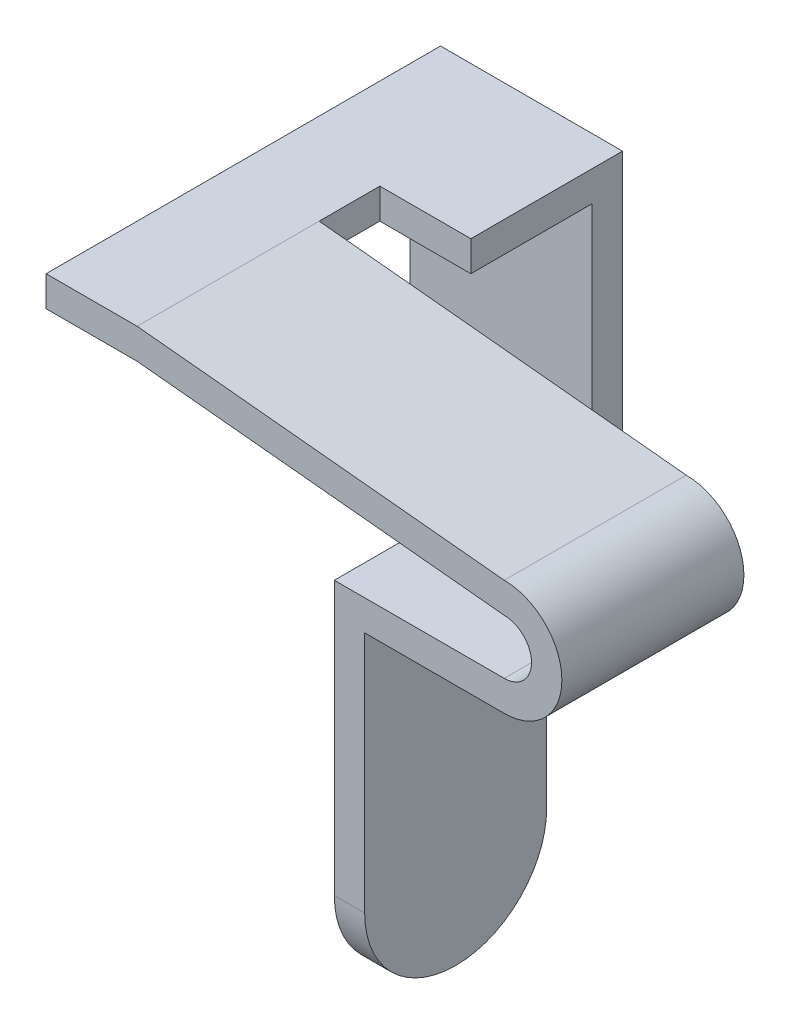
ISO-10303-21;
HEADER;
FILE_DESCRIPTION(('STEP AP214'),'2;1');
FILE_NAME('part.step','',(''),(''),'','','');
FILE_SCHEMA(('AUTOMOTIVE_DESIGN { 1 0 10303 214 1 1 1 1 }'));
ENDSEC;
DATA;
#1=APPLICATION_CONTEXT('core data for automotive mechanical design processes');
#2=APPLICATION_PROTOCOL_DEFINITION('international standard','automotive_design',2000,#1);
#3=PRODUCT_CONTEXT('',#1,'mechanical');
#4=PRODUCT('Part','Part','',(#3));
#5=PRODUCT_RELATED_PRODUCT_CATEGORY('part','',(#4));
#6=PRODUCT_DEFINITION_FORMATION('','',#4);
#7=PRODUCT_DEFINITION_CONTEXT('part definition',#1,'design');
#8=PRODUCT_DEFINITION('design','',#6,#7);
#9=PRODUCT_DEFINITION_SHAPE('','',#8);
#10=(LENGTH_UNIT() NAMED_UNIT(*) SI_UNIT(.MILLI.,.METRE.));
#11=(NAMED_UNIT(*) PLANE_ANGLE_UNIT() SI_UNIT($,.RADIAN.));
#12=(NAMED_UNIT(*) SI_UNIT($,.STERADIAN.) SOLID_ANGLE_UNIT());
#13=UNCERTAINTY_MEASURE_WITH_UNIT(LENGTH_MEASURE(1.E-05),#10,'distance_accuracy_value','');
#14=(GEOMETRIC_REPRESENTATION_CONTEXT(3) GLOBAL_UNCERTAINTY_ASSIGNED_CONTEXT((#13)) GLOBAL_UNIT_ASSIGNED_CONTEXT((#10,
#11,#12)) REPRESENTATION_CONTEXT('',''));
#15=CARTESIAN_POINT('',(0.,0.,0.));
#16=DIRECTION('',(0.,0.,1.));
#17=DIRECTION('',(1.,0.,0.));
#18=AXIS2_PLACEMENT_3D('',#15,#16,#17);
#19=CARTESIAN_POINT('',(0.,0.,3.));
#20=DIRECTION('',(0.,1.,0.));
#21=DIRECTION('',(0.,0.,1.));
#22=AXIS2_PLACEMENT_3D('',#19,#20,#21);
#23=PLANE('',#22);
#24=DIRECTION('',(-1.,0.,0.));
#25=VECTOR('',#24,1.);
#26=CARTESIAN_POINT('',(0.,0.,-3.));
#27=LINE('',#26,#25);
#28=CARTESIAN_POINT('',(3.,0.,-3.));
#29=VERTEX_POINT('',#28);
#30=CARTESIAN_POINT('',(0.,0.,-3.));
#31=VERTEX_POINT('',#30);
#32=EDGE_CURVE('E310',#29,#31,#27,.T.);
#33=ORIENTED_EDGE('',*,*,#32,.F.);
#34=DIRECTION('',(0.,0.,1.));
#35=VECTOR('',#34,1.);
#36=CARTESIAN_POINT('',(3.,0.,-3.5));
#37=LINE('',#36,#35);
#38=CARTESIAN_POINT('',(3.,0.,-1.));
#39=VERTEX_POINT('',#38);
#40=EDGE_CURVE('E213',#29,#39,#37,.T.);
#41=ORIENTED_EDGE('',*,*,#40,.T.);
#42=DIRECTION('',(-1.,0.,0.));
#43=VECTOR('',#42,1.);
#44=CARTESIAN_POINT('',(3.,0.,-1.));
#45=LINE('',#44,#43);
#46=CARTESIAN_POINT('',(1.5,0.,-1.));
#47=VERTEX_POINT('',#46);
#48=EDGE_CURVE('E203',#39,#47,#45,.T.);
#49=ORIENTED_EDGE('',*,*,#48,.T.);
#50=DIRECTION('',(0.,0.,1.));
#51=VECTOR('',#50,1.);
#52=CARTESIAN_POINT('',(1.5,0.,-1.));
#53=LINE('',#52,#51);
#54=CARTESIAN_POINT('',(1.5,0.,0.));
#55=VERTEX_POINT('',#54);
#56=EDGE_CURVE('E198',#47,#55,#53,.T.);
#57=ORIENTED_EDGE('',*,*,#56,.T.);
#58=DIRECTION('',(0.,0.,-1.));
#59=VECTOR('',#58,1.);
#60=CARTESIAN_POINT('',(1.5,0.,3.));
#61=LINE('',#60,#59);
#62=CARTESIAN_POINT('',(1.5,0.,3.));
#63=VERTEX_POINT('',#62);
#64=EDGE_CURVE('E283',#63,#55,#61,.T.);
#65=ORIENTED_EDGE('',*,*,#64,.F.);
#66=DIRECTION('',(1.,0.,0.));
#67=VECTOR('',#66,1.);
#68=CARTESIAN_POINT('',(0.,0.,3.));
#69=LINE('',#68,#67);
#70=CARTESIAN_POINT('',(0.,0.,3.));
#71=VERTEX_POINT('',#70);
#72=EDGE_CURVE('E228',#71,#63,#69,.T.);
#73=ORIENTED_EDGE('',*,*,#72,.F.);
#74=DIRECTION('',(0.,0.,-1.));
#75=VECTOR('',#74,1.);
#76=CARTESIAN_POINT('',(0.,0.,3.));
#77=LINE('',#76,#75);
#78=EDGE_CURVE('E286',#71,#31,#77,.T.);
#79=ORIENTED_EDGE('',*,*,#78,.T.);
#80=EDGE_LOOP('',(#33,#41,#49,#57,#65,#73,#79));
#81=FACE_BOUND('',#80,.T.);
#82=ADVANCED_FACE('F33',(#81),#23,.F.);
#83=CARTESIAN_POINT('',(0.,0.,3.));
#84=DIRECTION('',(1.,0.,0.));
#85=DIRECTION('',(0.,0.,-1.));
#86=AXIS2_PLACEMENT_3D('',#83,#84,#85);
#87=PLANE('',#86);
#88=DIRECTION('',(0.,-1.,0.));
#89=VECTOR('',#88,1.);
#90=CARTESIAN_POINT('',(0.,0.5,-3.5));
#91=LINE('',#90,#89);
#92=CARTESIAN_POINT('',(0.,0.5,-3.5));
#93=VERTEX_POINT('',#92);
#94=CARTESIAN_POINT('',(0.,-6.,-3.5));
#95=VERTEX_POINT('',#94);
#96=EDGE_CURVE('E171',#93,#95,#91,.T.);
#97=ORIENTED_EDGE('',*,*,#96,.T.);
#98=DIRECTION('',(0.,0.,1.));
#99=VECTOR('',#98,1.);
#100=CARTESIAN_POINT('',(0.,-6.,3.));
#101=LINE('',#100,#99);
#102=CARTESIAN_POINT('',(0.,-6.,-3.));
#103=VERTEX_POINT('',#102);
#104=EDGE_CURVE('E289',#95,#103,#101,.T.);
#105=ORIENTED_EDGE('',*,*,#104,.T.);
#106=DIRECTION('',(0.,1.,0.));
#107=VECTOR('',#106,1.);
#108=CARTESIAN_POINT('',(0.,-10.5413812651491,-3.));
#109=LINE('',#108,#107);
#110=EDGE_CURVE('E314',#103,#31,#109,.T.);
#111=ORIENTED_EDGE('',*,*,#110,.T.);
#112=ORIENTED_EDGE('',*,*,#78,.F.);
#113=DIRECTION('',(0.,-1.,0.));
#114=VECTOR('',#113,1.);
#115=CARTESIAN_POINT('',(0.,0.,3.));
#116=LINE('',#115,#114);
#117=CARTESIAN_POINT('',(0.,0.5,3.));
#118=VERTEX_POINT('',#117);
#119=EDGE_CURVE('E175',#118,#71,#116,.T.);
#120=ORIENTED_EDGE('',*,*,#119,.F.);
#121=DIRECTION('',(0.,0.,-1.));
#122=VECTOR('',#121,1.);
#123=CARTESIAN_POINT('',(0.,0.5,3.));
#124=LINE('',#123,#122);
#125=EDGE_CURVE('E167',#118,#93,#124,.T.);
#126=ORIENTED_EDGE('',*,*,#125,.T.);
#127=EDGE_LOOP('',(#97,#105,#111,#112,#120,#126));
#128=FACE_BOUND('',#127,.T.);
#129=ADVANCED_FACE('F169',(#128),#87,.F.);
#130=CARTESIAN_POINT('',(1.5,0.,3.));
#131=DIRECTION('',(0.0986894165901574,0.995118283950754,0.));
#132=DIRECTION('',(-0.995118283950755,0.0986894165901574,0.));
#133=AXIS2_PLACEMENT_3D('',#130,#131,#132);
#134=PLANE('',#133);
#135=DIRECTION('',(0.995118283950755,-0.0986894165901574,0.));
#136=VECTOR('',#135,1.);
#137=CARTESIAN_POINT('',(1.5,0.,0.));
#138=LINE('',#137,#136);
#139=CARTESIAN_POINT('',(7.55,-0.6,0.));
#140=VERTEX_POINT('',#139);
#141=EDGE_CURVE('E220',#55,#140,#138,.T.);
#142=ORIENTED_EDGE('',*,*,#141,.T.);
#143=DIRECTION('',(0.,0.,-1.));
#144=VECTOR('',#143,1.);
#145=CARTESIAN_POINT('',(7.55,-0.6,3.));
#146=LINE('',#145,#144);
#147=CARTESIAN_POINT('',(7.55,-0.6,3.));
#148=VERTEX_POINT('',#147);
#149=EDGE_CURVE('E280',#148,#140,#146,.T.);
#150=ORIENTED_EDGE('',*,*,#149,.F.);
#151=DIRECTION('',(0.995118283950755,-0.0986894165901574,0.));
#152=VECTOR('',#151,1.);
#153=CARTESIAN_POINT('',(1.5,0.,3.));
#154=LINE('',#153,#152);
#155=EDGE_CURVE('E231',#63,#148,#154,.T.);
#156=ORIENTED_EDGE('',*,*,#155,.F.);
#157=ORIENTED_EDGE('',*,*,#64,.T.);
#158=EDGE_LOOP('',(#142,#150,#156,#157));
#159=FACE_BOUND('',#158,.T.);
#160=ADVANCED_FACE('F358',(#159),#134,.F.);
#161=CARTESIAN_POINT('',(7.55,-1.05,3.));
#162=DIRECTION('',(0.,0.,-1.));
#163=DIRECTION('',(-1.,0.,0.));
#164=AXIS2_PLACEMENT_3D('',#161,#162,#163);
#165=CYLINDRICAL_SURFACE('',#164,0.45);
#166=CARTESIAN_POINT('',(7.55,-1.05,0.));
#167=DIRECTION('',(0.,0.,-1.));
#168=DIRECTION('',(-1.,0.,0.));
#169=AXIS2_PLACEMENT_3D('',#166,#167,#168);
#170=CIRCLE('',#169,0.45);
#171=CARTESIAN_POINT('',(7.55,-1.5,0.));
#172=VERTEX_POINT('',#171);
#173=EDGE_CURVE('E250',#140,#172,#170,.T.);
#174=ORIENTED_EDGE('',*,*,#173,.T.);
#175=DIRECTION('',(0.,0.,-1.));
#176=VECTOR('',#175,1.);
#177=CARTESIAN_POINT('',(7.55,-1.5,3.));
#178=LINE('',#177,#176);
#179=CARTESIAN_POINT('',(7.55,-1.5,3.));
#180=VERTEX_POINT('',#179);
#181=EDGE_CURVE('E277',#180,#172,#178,.T.);
#182=ORIENTED_EDGE('',*,*,#181,.F.);
#183=CARTESIAN_POINT('',(7.55,-1.05,3.));
#184=DIRECTION('',(0.,0.,-1.));
#185=DIRECTION('',(-1.,0.,0.));
#186=AXIS2_PLACEMENT_3D('',#183,#184,#185);
#187=CIRCLE('',#186,0.45);
#188=EDGE_CURVE('E233',#148,#180,#187,.T.);
#189=ORIENTED_EDGE('',*,*,#188,.F.);
#190=ORIENTED_EDGE('',*,*,#149,.T.);
#191=EDGE_LOOP('',(#174,#182,#189,#190));
#192=FACE_BOUND('',#191,.T.);
#193=ADVANCED_FACE('F354',(#192),#165,.F.);
#194=CARTESIAN_POINT('',(7.55,-1.5,3.));
#195=DIRECTION('',(0.,-1.,0.));
#196=DIRECTION('',(1.,0.,0.));
#197=AXIS2_PLACEMENT_3D('',#194,#195,#196);
#198=PLANE('',#197);
#199=DIRECTION('',(-1.,0.,0.));
#200=VECTOR('',#199,1.);
#201=CARTESIAN_POINT('',(7.55,-1.5,0.));
#202=LINE('',#201,#200);
#203=CARTESIAN_POINT('',(4.75,-1.5,0.));
#204=VERTEX_POINT('',#203);
#205=EDGE_CURVE('E252',#172,#204,#202,.T.);
#206=ORIENTED_EDGE('',*,*,#205,.T.);
#207=DIRECTION('',(0.,0.,-1.));
#208=VECTOR('',#207,1.);
#209=CARTESIAN_POINT('',(4.75,-1.5,3.));
#210=LINE('',#209,#208);
#211=CARTESIAN_POINT('',(4.75,-1.5,3.));
#212=VERTEX_POINT('',#211);
#213=EDGE_CURVE('E274',#212,#204,#210,.T.);
#214=ORIENTED_EDGE('',*,*,#213,.F.);
#215=DIRECTION('',(-1.,0.,0.));
#216=VECTOR('',#215,1.);
#217=CARTESIAN_POINT('',(7.55,-1.5,3.));
#218=LINE('',#217,#216);
#219=EDGE_CURVE('E235',#180,#212,#218,.T.);
#220=ORIENTED_EDGE('',*,*,#219,.F.);
#221=ORIENTED_EDGE('',*,*,#181,.T.);
#222=EDGE_LOOP('',(#206,#214,#220,#221));
#223=FACE_BOUND('',#222,.T.);
#224=ADVANCED_FACE('F350',(#223),#198,.F.);
#225=CARTESIAN_POINT('',(4.75,-1.5,3.));
#226=DIRECTION('',(1.,0.,0.));
#227=DIRECTION('',(0.,1.,0.));
#228=AXIS2_PLACEMENT_3D('',#225,#226,#227);
#229=PLANE('',#228);
#230=CARTESIAN_POINT('',(4.75,-6.,1.5));
#231=DIRECTION('',(1.,0.,0.));
#232=DIRECTION('',(0.,1.,0.));
#233=AXIS2_PLACEMENT_3D('',#230,#231,#232);
#234=CIRCLE('',#233,1.5);
#235=CARTESIAN_POINT('',(4.75,-6.,0.));
#236=VERTEX_POINT('',#235);
#237=CARTESIAN_POINT('',(4.75,-7.5,1.5));
#238=VERTEX_POINT('',#237);
#239=EDGE_CURVE('E50',#236,#238,#234,.F.);
#240=ORIENTED_EDGE('',*,*,#239,.T.);
#241=CARTESIAN_POINT('',(4.75,-6.,1.5));
#242=DIRECTION('',(1.,0.,0.));
#243=DIRECTION('',(0.,1.,0.));
#244=AXIS2_PLACEMENT_3D('',#241,#242,#243);
#245=CIRCLE('',#244,1.5);
#246=CARTESIAN_POINT('',(4.75,-6.,3.));
#247=VERTEX_POINT('',#246);
#248=EDGE_CURVE('E42',#238,#247,#245,.F.);
#249=ORIENTED_EDGE('',*,*,#248,.T.);
#250=DIRECTION('',(0.,-1.,0.));
#251=VECTOR('',#250,1.);
#252=CARTESIAN_POINT('',(4.75,-1.5,3.));
#253=LINE('',#252,#251);
#254=EDGE_CURVE('E237',#212,#247,#253,.T.);
#255=ORIENTED_EDGE('',*,*,#254,.F.);
#256=ORIENTED_EDGE('',*,*,#213,.T.);
#257=DIRECTION('',(0.,-1.,0.));
#258=VECTOR('',#257,1.);
#259=CARTESIAN_POINT('',(4.75,-1.5,0.));
#260=LINE('',#259,#258);
#261=EDGE_CURVE('E254',#204,#236,#260,.T.);
#262=ORIENTED_EDGE('',*,*,#261,.T.);
#263=EDGE_LOOP('',(#240,#249,#255,#256,#262));
#264=FACE_BOUND('',#263,.T.);
#265=ADVANCED_FACE('F346',(#264),#229,.F.);
#266=CARTESIAN_POINT('',(5.25,-7.5,3.));
#267=DIRECTION('',(-1.,0.,0.));
#268=DIRECTION('',(0.,0.,1.));
#269=AXIS2_PLACEMENT_3D('',#266,#267,#268);
#270=PLANE('',#269);
#271=DIRECTION('',(0.,1.,0.));
#272=VECTOR('',#271,1.);
#273=CARTESIAN_POINT('',(5.25,-7.5,3.));
#274=LINE('',#273,#272);
#275=CARTESIAN_POINT('',(5.25,-6.,3.));
#276=VERTEX_POINT('',#275);
#277=CARTESIAN_POINT('',(5.25,-2.,3.));
#278=VERTEX_POINT('',#277);
#279=EDGE_CURVE('E240',#276,#278,#274,.T.);
#280=ORIENTED_EDGE('',*,*,#279,.F.);
#281=CARTESIAN_POINT('',(5.25,-6.,1.5));
#282=DIRECTION('',(-1.,0.,0.));
#283=DIRECTION('',(0.,0.,1.));
#284=AXIS2_PLACEMENT_3D('',#281,#282,#283);
#285=CIRCLE('',#284,1.5);
#286=CARTESIAN_POINT('',(5.25,-7.5,1.5));
#287=VERTEX_POINT('',#286);
#288=EDGE_CURVE('E305',#276,#287,#285,.F.);
#289=ORIENTED_EDGE('',*,*,#288,.T.);
#290=CARTESIAN_POINT('',(5.25,-6.,1.5));
#291=DIRECTION('',(-1.,0.,0.));
#292=DIRECTION('',(0.,0.,1.));
#293=AXIS2_PLACEMENT_3D('',#290,#291,#292);
#294=CIRCLE('',#293,1.5);
#295=CARTESIAN_POINT('',(5.25,-6.,0.));
#296=VERTEX_POINT('',#295);
#297=EDGE_CURVE('E303',#287,#296,#294,.F.);
#298=ORIENTED_EDGE('',*,*,#297,.T.);
#299=DIRECTION('',(0.,1.,0.));
#300=VECTOR('',#299,1.);
#301=CARTESIAN_POINT('',(5.25,-7.5,0.));
#302=LINE('',#301,#300);
#303=CARTESIAN_POINT('',(5.25,-2.,0.));
#304=VERTEX_POINT('',#303);
#305=EDGE_CURVE('E256',#296,#304,#302,.T.);
#306=ORIENTED_EDGE('',*,*,#305,.T.);
#307=DIRECTION('',(0.,0.,-1.));
#308=VECTOR('',#307,1.);
#309=CARTESIAN_POINT('',(5.25,-2.,3.));
#310=LINE('',#309,#308);
#311=EDGE_CURVE('E271',#278,#304,#310,.T.);
#312=ORIENTED_EDGE('',*,*,#311,.F.);
#313=EDGE_LOOP('',(#280,#289,#298,#306,#312));
#314=FACE_BOUND('',#313,.T.);
#315=ADVANCED_FACE('F325',(#314),#270,.F.);
#316=CARTESIAN_POINT('',(5.25,-2.,3.));
#317=DIRECTION('',(0.,1.,0.));
#318=DIRECTION('',(0.,0.,1.));
#319=AXIS2_PLACEMENT_3D('',#316,#317,#318);
#320=PLANE('',#319);
#321=DIRECTION('',(1.,0.,0.));
#322=VECTOR('',#321,1.);
#323=CARTESIAN_POINT('',(5.25,-2.,0.));
#324=LINE('',#323,#322);
#325=CARTESIAN_POINT('',(7.55,-2.,0.));
#326=VERTEX_POINT('',#325);
#327=EDGE_CURVE('E258',#304,#326,#324,.T.);
#328=ORIENTED_EDGE('',*,*,#327,.T.);
#329=DIRECTION('',(0.,0.,-1.));
#330=VECTOR('',#329,1.);
#331=CARTESIAN_POINT('',(7.55,-2.,3.));
#332=LINE('',#331,#330);
#333=CARTESIAN_POINT('',(7.55,-2.,3.));
#334=VERTEX_POINT('',#333);
#335=EDGE_CURVE('E268',#334,#326,#332,.T.);
#336=ORIENTED_EDGE('',*,*,#335,.F.);
#337=DIRECTION('',(1.,0.,0.));
#338=VECTOR('',#337,1.);
#339=CARTESIAN_POINT('',(5.25,-2.,3.));
#340=LINE('',#339,#338);
#341=EDGE_CURVE('E242',#278,#334,#340,.T.);
#342=ORIENTED_EDGE('',*,*,#341,.F.);
#343=ORIENTED_EDGE('',*,*,#311,.T.);
#344=EDGE_LOOP('',(#328,#336,#342,#343));
#345=FACE_BOUND('',#344,.T.);
#346=ADVANCED_FACE('F333',(#345),#320,.F.);
#347=CARTESIAN_POINT('',(7.55,-1.05,3.));
#348=DIRECTION('',(0.,0.,-1.));
#349=DIRECTION('',(-1.,0.,0.));
#350=AXIS2_PLACEMENT_3D('',#347,#348,#349);
#351=CYLINDRICAL_SURFACE('',#350,0.95);
#352=CARTESIAN_POINT('',(7.55,-1.05,0.));
#353=DIRECTION('',(0.,0.,1.));
#354=DIRECTION('',(-1.,0.,0.));
#355=AXIS2_PLACEMENT_3D('',#352,#353,#354);
#356=CIRCLE('',#355,0.95);
#357=CARTESIAN_POINT('',(7.55,-0.0999999999999998,0.));
#358=VERTEX_POINT('',#357);
#359=EDGE_CURVE('E260',#326,#358,#356,.T.);
#360=ORIENTED_EDGE('',*,*,#359,.T.);
#361=DIRECTION('',(0.,0.,-1.));
#362=VECTOR('',#361,1.);
#363=CARTESIAN_POINT('',(7.55,-0.0999999999999998,3.));
#364=LINE('',#363,#362);
#365=CARTESIAN_POINT('',(7.55,-0.0999999999999998,3.));
#366=VERTEX_POINT('',#365);
#367=EDGE_CURVE('E265',#366,#358,#364,.T.);
#368=ORIENTED_EDGE('',*,*,#367,.F.);
#369=CARTESIAN_POINT('',(7.55,-1.05,3.));
#370=DIRECTION('',(0.,0.,1.));
#371=DIRECTION('',(-1.,0.,0.));
#372=AXIS2_PLACEMENT_3D('',#369,#370,#371);
#373=CIRCLE('',#372,0.95);
#374=EDGE_CURVE('E244',#334,#366,#373,.T.);
#375=ORIENTED_EDGE('',*,*,#374,.F.);
#376=ORIENTED_EDGE('',*,*,#335,.T.);
#377=EDGE_LOOP('',(#360,#368,#375,#376));
#378=FACE_BOUND('',#377,.T.);
#379=ADVANCED_FACE('F337',(#378),#351,.T.);
#380=CARTESIAN_POINT('',(1.5,0.5,3.));
#381=DIRECTION('',(-0.0986894165901574,-0.995118283950755,0.));
#382=DIRECTION('',(0.995118283950755,-0.0986894165901574,0.));
#383=AXIS2_PLACEMENT_3D('',#380,#381,#382);
#384=PLANE('',#383);
#385=DIRECTION('',(-0.995118283950754,0.0986894165901574,0.));
#386=VECTOR('',#385,1.);
#387=CARTESIAN_POINT('',(1.5,0.5,0.));
#388=LINE('',#387,#386);
#389=CARTESIAN_POINT('',(1.5,0.5,0.));
#390=VERTEX_POINT('',#389);
#391=EDGE_CURVE('E229',#358,#390,#388,.T.);
#392=ORIENTED_EDGE('',*,*,#391,.T.);
#393=DIRECTION('',(0.,0.,-1.));
#394=VECTOR('',#393,1.);
#395=CARTESIAN_POINT('',(1.5,0.5,3.));
#396=LINE('',#395,#394);
#397=CARTESIAN_POINT('',(1.5,0.5,3.));
#398=VERTEX_POINT('',#397);
#399=EDGE_CURVE('E179',#398,#390,#396,.T.);
#400=ORIENTED_EDGE('',*,*,#399,.F.);
#401=DIRECTION('',(-0.995118283950754,0.0986894165901574,0.));
#402=VECTOR('',#401,1.);
#403=CARTESIAN_POINT('',(1.5,0.5,3.));
#404=LINE('',#403,#402);
#405=EDGE_CURVE('E246',#366,#398,#404,.T.);
#406=ORIENTED_EDGE('',*,*,#405,.F.);
#407=ORIENTED_EDGE('',*,*,#367,.T.);
#408=EDGE_LOOP('',(#392,#400,#406,#407));
#409=FACE_BOUND('',#408,.T.);
#410=ADVANCED_FACE('F363',(#409),#384,.F.);
#411=CARTESIAN_POINT('',(0.,0.5,3.));
#412=DIRECTION('',(0.,-1.,0.));
#413=DIRECTION('',(0.,0.,-1.));
#414=AXIS2_PLACEMENT_3D('',#411,#412,#413);
#415=PLANE('',#414);
#416=ORIENTED_EDGE('',*,*,#399,.T.);
#417=DIRECTION('',(0.,0.,1.));
#418=VECTOR('',#417,1.);
#419=CARTESIAN_POINT('',(1.5,0.5,-1.));
#420=LINE('',#419,#418);
#421=CARTESIAN_POINT('',(1.5,0.5,-1.));
#422=VERTEX_POINT('',#421);
#423=EDGE_CURVE('E190',#422,#390,#420,.T.);
#424=ORIENTED_EDGE('',*,*,#423,.F.);
#425=DIRECTION('',(-1.,0.,0.));
#426=VECTOR('',#425,1.);
#427=CARTESIAN_POINT('',(3.,0.5,-1.));
#428=LINE('',#427,#426);
#429=CARTESIAN_POINT('',(3.,0.5,-1.));
#430=VERTEX_POINT('',#429);
#431=EDGE_CURVE('E200',#430,#422,#428,.T.);
#432=ORIENTED_EDGE('',*,*,#431,.F.);
#433=DIRECTION('',(0.,0.,1.));
#434=VECTOR('',#433,1.);
#435=CARTESIAN_POINT('',(3.,0.5,-3.5));
#436=LINE('',#435,#434);
#437=CARTESIAN_POINT('',(3.,0.5,-3.5));
#438=VERTEX_POINT('',#437);
#439=EDGE_CURVE('E197',#438,#430,#436,.T.);
#440=ORIENTED_EDGE('',*,*,#439,.F.);
#441=DIRECTION('',(1.,0.,0.));
#442=VECTOR('',#441,1.);
#443=CARTESIAN_POINT('',(0.,0.5,-3.5));
#444=LINE('',#443,#442);
#445=EDGE_CURVE('E186',#93,#438,#444,.T.);
#446=ORIENTED_EDGE('',*,*,#445,.F.);
#447=ORIENTED_EDGE('',*,*,#125,.F.);
#448=DIRECTION('',(-1.,0.,0.));
#449=VECTOR('',#448,1.);
#450=CARTESIAN_POINT('',(0.,0.5,3.));
#451=LINE('',#450,#449);
#452=EDGE_CURVE('E180',#398,#118,#451,.T.);
#453=ORIENTED_EDGE('',*,*,#452,.F.);
#454=EDGE_LOOP('',(#416,#424,#432,#440,#446,#447,#453));
#455=FACE_BOUND('',#454,.T.);
#456=ADVANCED_FACE('F194',(#455),#415,.F.);
#457=CARTESIAN_POINT('',(7.55,-1.05,3.));
#458=DIRECTION('',(0.,0.,-1.));
#459=DIRECTION('',(-1.,0.,0.));
#460=AXIS2_PLACEMENT_3D('',#457,#458,#459);
#461=PLANE('',#460);
#462=ORIENTED_EDGE('',*,*,#254,.T.);
#463=DIRECTION('',(1.,0.,0.));
#464=VECTOR('',#463,1.);
#465=CARTESIAN_POINT('',(7.55,-6.,3.));
#466=LINE('',#465,#464);
#467=EDGE_CURVE('E300',#247,#276,#466,.T.);
#468=ORIENTED_EDGE('',*,*,#467,.T.);
#469=ORIENTED_EDGE('',*,*,#279,.T.);
#470=ORIENTED_EDGE('',*,*,#341,.T.);
#471=ORIENTED_EDGE('',*,*,#374,.T.);
#472=ORIENTED_EDGE('',*,*,#405,.T.);
#473=ORIENTED_EDGE('',*,*,#452,.T.);
#474=ORIENTED_EDGE('',*,*,#119,.T.);
#475=ORIENTED_EDGE('',*,*,#72,.T.);
#476=ORIENTED_EDGE('',*,*,#155,.T.);
#477=ORIENTED_EDGE('',*,*,#188,.T.);
#478=ORIENTED_EDGE('',*,*,#219,.T.);
#479=EDGE_LOOP('',(#462,#468,#469,#470,#471,#472,#473,#474,#475,#476,#477,#478));
#480=FACE_BOUND('',#479,.T.);
#481=ADVANCED_FACE('F341',(#480),#461,.F.);
#482=CARTESIAN_POINT('',(7.55,-1.05,0.));
#483=DIRECTION('',(0.,0.,-1.));
#484=DIRECTION('',(-1.,0.,0.));
#485=AXIS2_PLACEMENT_3D('',#482,#483,#484);
#486=PLANE('',#485);
#487=ORIENTED_EDGE('',*,*,#305,.F.);
#488=DIRECTION('',(1.,0.,0.));
#489=VECTOR('',#488,1.);
#490=CARTESIAN_POINT('',(4.75,-6.,0.));
#491=LINE('',#490,#489);
#492=EDGE_CURVE('E11',#296,#236,#491,.F.);
#493=ORIENTED_EDGE('',*,*,#492,.T.);
#494=ORIENTED_EDGE('',*,*,#261,.F.);
#495=ORIENTED_EDGE('',*,*,#205,.F.);
#496=ORIENTED_EDGE('',*,*,#173,.F.);
#497=ORIENTED_EDGE('',*,*,#141,.F.);
#498=DIRECTION('',(0.,-1.,0.));
#499=VECTOR('',#498,1.);
#500=CARTESIAN_POINT('',(1.5,0.5,0.));
#501=LINE('',#500,#499);
#502=EDGE_CURVE('E217',#390,#55,#501,.T.);
#503=ORIENTED_EDGE('',*,*,#502,.F.);
#504=ORIENTED_EDGE('',*,*,#391,.F.);
#505=ORIENTED_EDGE('',*,*,#359,.F.);
#506=ORIENTED_EDGE('',*,*,#327,.F.);
#507=EDGE_LOOP('',(#487,#493,#494,#495,#496,#497,#503,#504,#505,#506));
#508=FACE_BOUND('',#507,.T.);
#509=ADVANCED_FACE('F328',(#508),#486,.T.);
#510=CARTESIAN_POINT('',(1.5,0.5,-1.));
#511=DIRECTION('',(1.,0.,0.));
#512=DIRECTION('',(0.,0.,-1.));
#513=AXIS2_PLACEMENT_3D('',#510,#511,#512);
#514=PLANE('',#513);
#515=ORIENTED_EDGE('',*,*,#56,.F.);
#516=DIRECTION('',(0.,-1.,0.));
#517=VECTOR('',#516,1.);
#518=CARTESIAN_POINT('',(1.5,0.5,-1.));
#519=LINE('',#518,#517);
#520=EDGE_CURVE('E221',#422,#47,#519,.T.);
#521=ORIENTED_EDGE('',*,*,#520,.F.);
#522=ORIENTED_EDGE('',*,*,#423,.T.);
#523=ORIENTED_EDGE('',*,*,#502,.T.);
#524=EDGE_LOOP('',(#515,#521,#522,#523));
#525=FACE_BOUND('',#524,.T.);
#526=ADVANCED_FACE('F365',(#525),#514,.T.);
#527=CARTESIAN_POINT('',(3.,0.5,-1.));
#528=DIRECTION('',(0.,0.,1.));
#529=DIRECTION('',(1.,0.,0.));
#530=AXIS2_PLACEMENT_3D('',#527,#528,#529);
#531=PLANE('',#530);
#532=ORIENTED_EDGE('',*,*,#48,.F.);
#533=DIRECTION('',(0.,-1.,0.));
#534=VECTOR('',#533,1.);
#535=CARTESIAN_POINT('',(3.,0.5,-1.));
#536=LINE('',#535,#534);
#537=EDGE_CURVE('E223',#430,#39,#536,.T.);
#538=ORIENTED_EDGE('',*,*,#537,.F.);
#539=ORIENTED_EDGE('',*,*,#431,.T.);
#540=ORIENTED_EDGE('',*,*,#520,.T.);
#541=EDGE_LOOP('',(#532,#538,#539,#540));
#542=FACE_BOUND('',#541,.T.);
#543=ADVANCED_FACE('F368',(#542),#531,.T.);
#544=CARTESIAN_POINT('',(3.,0.5,-3.5));
#545=DIRECTION('',(1.,0.,0.));
#546=DIRECTION('',(0.,0.,-1.));
#547=AXIS2_PLACEMENT_3D('',#544,#545,#546);
#548=PLANE('',#547);
#549=DIRECTION('',(0.,1.,0.));
#550=VECTOR('',#549,1.);
#551=CARTESIAN_POINT('',(3.,-10.5413812651491,-3.));
#552=LINE('',#551,#550);
#553=CARTESIAN_POINT('',(3.,-6.,-3.));
#554=VERTEX_POINT('',#553);
#555=EDGE_CURVE('E206',#554,#29,#552,.T.);
#556=ORIENTED_EDGE('',*,*,#555,.F.);
#557=DIRECTION('',(0.,0.,-1.));
#558=VECTOR('',#557,1.);
#559=CARTESIAN_POINT('',(3.,-6.,-3.5));
#560=LINE('',#559,#558);
#561=CARTESIAN_POINT('',(3.,-6.,-3.5));
#562=VERTEX_POINT('',#561);
#563=EDGE_CURVE('E298',#554,#562,#560,.T.);
#564=ORIENTED_EDGE('',*,*,#563,.T.);
#565=DIRECTION('',(0.,-1.,0.));
#566=VECTOR('',#565,1.);
#567=CARTESIAN_POINT('',(3.,0.5,-3.5));
#568=LINE('',#567,#566);
#569=EDGE_CURVE('E189',#438,#562,#568,.T.);
#570=ORIENTED_EDGE('',*,*,#569,.F.);
#571=ORIENTED_EDGE('',*,*,#439,.T.);
#572=ORIENTED_EDGE('',*,*,#537,.T.);
#573=ORIENTED_EDGE('',*,*,#40,.F.);
#574=EDGE_LOOP('',(#556,#564,#570,#571,#572,#573));
#575=FACE_BOUND('',#574,.T.);
#576=ADVANCED_FACE('F371',(#575),#548,.T.);
#577=CARTESIAN_POINT('',(0.,0.5,-3.5));
#578=DIRECTION('',(0.,0.,-1.));
#579=DIRECTION('',(-1.,0.,0.));
#580=AXIS2_PLACEMENT_3D('',#577,#578,#579);
#581=PLANE('',#580);
#582=CARTESIAN_POINT('',(1.5,-6.,-3.5));
#583=DIRECTION('',(0.,0.,-1.));
#584=DIRECTION('',(-1.,0.,0.));
#585=AXIS2_PLACEMENT_3D('',#582,#583,#584);
#586=CIRCLE('',#585,1.5);
#587=CARTESIAN_POINT('',(1.5,-7.5,-3.5));
#588=VERTEX_POINT('',#587);
#589=EDGE_CURVE('E295',#562,#588,#586,.T.);
#590=ORIENTED_EDGE('',*,*,#589,.T.);
#591=CARTESIAN_POINT('',(1.5,-6.,-3.5));
#592=DIRECTION('',(0.,0.,-1.));
#593=DIRECTION('',(-1.,0.,0.));
#594=AXIS2_PLACEMENT_3D('',#591,#592,#593);
#595=CIRCLE('',#594,1.5);
#596=EDGE_CURVE('E188',#588,#95,#595,.T.);
#597=ORIENTED_EDGE('',*,*,#596,.T.);
#598=ORIENTED_EDGE('',*,*,#96,.F.);
#599=ORIENTED_EDGE('',*,*,#445,.T.);
#600=ORIENTED_EDGE('',*,*,#569,.T.);
#601=EDGE_LOOP('',(#590,#597,#598,#599,#600));
#602=FACE_BOUND('',#601,.T.);
#603=ADVANCED_FACE('F184',(#602),#581,.T.);
#604=CARTESIAN_POINT('',(0.,-10.5413812651491,-3.));
#605=DIRECTION('',(0.,0.,-1.));
#606=DIRECTION('',(-1.,0.,0.));
#607=AXIS2_PLACEMENT_3D('',#604,#605,#606);
#608=PLANE('',#607);
#609=ORIENTED_EDGE('',*,*,#110,.F.);
#610=CARTESIAN_POINT('',(1.5,-6.,-3.));
#611=DIRECTION('',(0.,0.,-1.));
#612=DIRECTION('',(-1.,0.,0.));
#613=AXIS2_PLACEMENT_3D('',#610,#611,#612);
#614=CIRCLE('',#613,1.5);
#615=CARTESIAN_POINT('',(1.5,-7.5,-3.));
#616=VERTEX_POINT('',#615);
#617=EDGE_CURVE('E293',#103,#616,#614,.F.);
#618=ORIENTED_EDGE('',*,*,#617,.T.);
#619=CARTESIAN_POINT('',(1.5,-6.,-3.));
#620=DIRECTION('',(0.,0.,-1.));
#621=DIRECTION('',(-1.,0.,0.));
#622=AXIS2_PLACEMENT_3D('',#619,#620,#621);
#623=CIRCLE('',#622,1.5);
#624=EDGE_CURVE('E291',#616,#554,#623,.F.);
#625=ORIENTED_EDGE('',*,*,#624,.T.);
#626=ORIENTED_EDGE('',*,*,#555,.T.);
#627=ORIENTED_EDGE('',*,*,#32,.T.);
#628=EDGE_LOOP('',(#609,#618,#625,#626,#627));
#629=FACE_BOUND('',#628,.T.);
#630=ADVANCED_FACE('F381',(#629),#608,.F.);
#631=CARTESIAN_POINT('',(1.5,-6.,-3.5));
#632=DIRECTION('',(0.,0.,1.));
#633=DIRECTION('',(1.,0.,0.));
#634=AXIS2_PLACEMENT_3D('',#631,#632,#633);
#635=CYLINDRICAL_SURFACE('',#634,1.5);
#636=DIRECTION('',(0.,0.,-1.));
#637=VECTOR('',#636,1.);
#638=CARTESIAN_POINT('',(1.5,-7.5,-3.));
#639=LINE('',#638,#637);
#640=EDGE_CURVE('E308',#588,#616,#639,.F.);
#641=ORIENTED_EDGE('',*,*,#640,.F.);
#642=ORIENTED_EDGE('',*,*,#589,.F.);
#643=ORIENTED_EDGE('',*,*,#563,.F.);
#644=ORIENTED_EDGE('',*,*,#624,.F.);
#645=EDGE_LOOP('',(#641,#642,#643,#644));
#646=FACE_BOUND('',#645,.T.);
#647=ADVANCED_FACE('F376',(#646),#635,.T.);
#648=CARTESIAN_POINT('',(1.5,-6.,3.));
#649=DIRECTION('',(0.,0.,1.));
#650=DIRECTION('',(1.,0.,0.));
#651=AXIS2_PLACEMENT_3D('',#648,#649,#650);
#652=CYLINDRICAL_SURFACE('',#651,1.5);
#653=ORIENTED_EDGE('',*,*,#596,.F.);
#654=ORIENTED_EDGE('',*,*,#640,.T.);
#655=ORIENTED_EDGE('',*,*,#617,.F.);
#656=ORIENTED_EDGE('',*,*,#104,.F.);
#657=EDGE_LOOP('',(#653,#654,#655,#656));
#658=FACE_BOUND('',#657,.T.);
#659=ADVANCED_FACE('F378',(#658),#652,.T.);
#660=CARTESIAN_POINT('',(4.75,-6.,1.5));
#661=DIRECTION('',(-1.,0.,0.));
#662=DIRECTION('',(0.,0.,1.));
#663=AXIS2_PLACEMENT_3D('',#660,#661,#662);
#664=CYLINDRICAL_SURFACE('',#663,1.5);
#665=DIRECTION('',(1.,0.,0.));
#666=VECTOR('',#665,1.);
#667=CARTESIAN_POINT('',(5.25,-7.5,1.5));
#668=LINE('',#667,#666);
#669=EDGE_CURVE('E37',#238,#287,#668,.T.);
#670=ORIENTED_EDGE('',*,*,#669,.F.);
#671=ORIENTED_EDGE('',*,*,#239,.F.);
#672=ORIENTED_EDGE('',*,*,#492,.F.);
#673=ORIENTED_EDGE('',*,*,#297,.F.);
#674=EDGE_LOOP('',(#670,#671,#672,#673));
#675=FACE_BOUND('',#674,.T.);
#676=ADVANCED_FACE('F35',(#675),#664,.T.);
#677=CARTESIAN_POINT('',(7.55,-6.,1.5));
#678=DIRECTION('',(1.,0.,0.));
#679=DIRECTION('',(0.,0.,-1.));
#680=AXIS2_PLACEMENT_3D('',#677,#678,#679);
#681=CYLINDRICAL_SURFACE('',#680,1.5);
#682=ORIENTED_EDGE('',*,*,#248,.F.);
#683=ORIENTED_EDGE('',*,*,#669,.T.);
#684=ORIENTED_EDGE('',*,*,#288,.F.);
#685=ORIENTED_EDGE('',*,*,#467,.F.);
#686=EDGE_LOOP('',(#682,#683,#684,#685));
#687=FACE_BOUND('',#686,.T.);
#688=ADVANCED_FACE('F319',(#687),#681,.T.);
#689=CLOSED_SHELL('',(#82,#129,#160,#193,#224,#265,#315,#346,#379,#410,#456,#481,#509,#526,#543,
#576,#603,#630,#647,#659,#676,#688));
#690=MANIFOLD_SOLID_BREP('B2',#689);
#691=ADVANCED_BREP_SHAPE_REPRESENTATION('',(#18,#690),#14);
#692=SHAPE_DEFINITION_REPRESENTATION(#9,#691);
ENDSEC;
END-ISO-10303-21;
